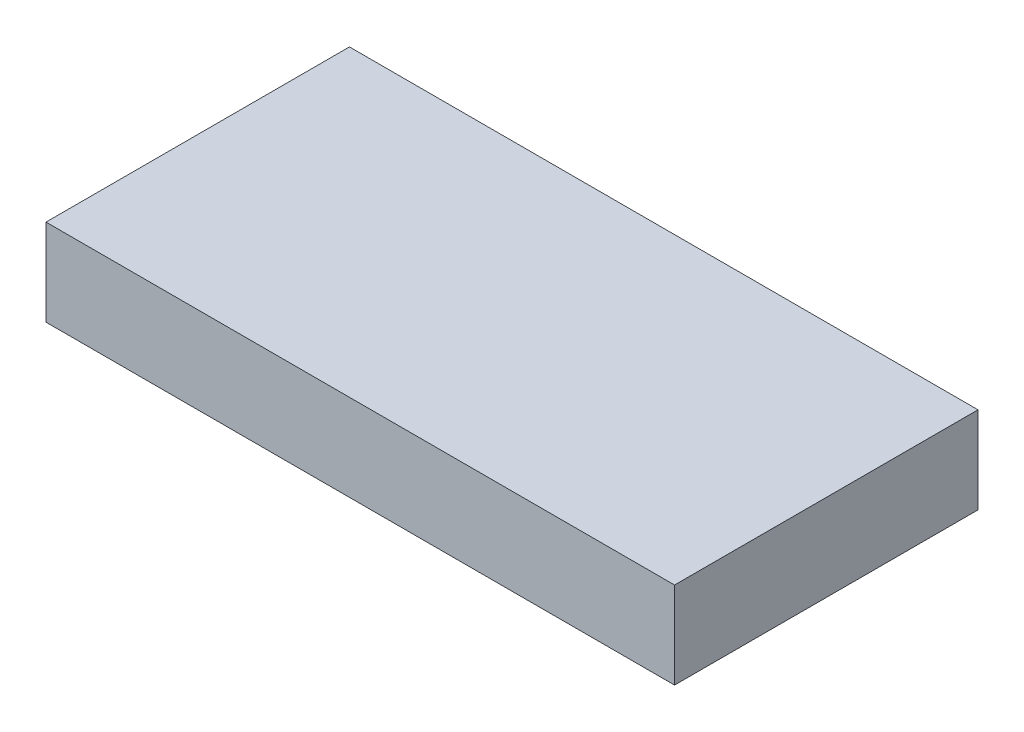
ISO-10303-21;
HEADER;
FILE_DESCRIPTION(('STEP AP214'),'2;1');
FILE_NAME('part.step','',(''),(''),'','','');
FILE_SCHEMA(('AUTOMOTIVE_DESIGN { 1 0 10303 214 1 1 1 1 }'));
ENDSEC;
DATA;
#1=APPLICATION_CONTEXT('core data for automotive mechanical design processes');
#2=APPLICATION_PROTOCOL_DEFINITION('international standard','automotive_design',2000,#1);
#3=PRODUCT_CONTEXT('',#1,'mechanical');
#4=PRODUCT('Part','Part','',(#3));
#5=PRODUCT_RELATED_PRODUCT_CATEGORY('part','',(#4));
#6=PRODUCT_DEFINITION_FORMATION('','',#4);
#7=PRODUCT_DEFINITION_CONTEXT('part definition',#1,'design');
#8=PRODUCT_DEFINITION('design','',#6,#7);
#9=PRODUCT_DEFINITION_SHAPE('','',#8);
#10=(LENGTH_UNIT() NAMED_UNIT(*) SI_UNIT(.MILLI.,.METRE.));
#11=(NAMED_UNIT(*) PLANE_ANGLE_UNIT() SI_UNIT($,.RADIAN.));
#12=(NAMED_UNIT(*) SI_UNIT($,.STERADIAN.) SOLID_ANGLE_UNIT());
#13=UNCERTAINTY_MEASURE_WITH_UNIT(LENGTH_MEASURE(1.E-05),#10,'distance_accuracy_value','');
#14=(GEOMETRIC_REPRESENTATION_CONTEXT(3) GLOBAL_UNCERTAINTY_ASSIGNED_CONTEXT((#13)) GLOBAL_UNIT_ASSIGNED_CONTEXT((#10,
#11,#12)) REPRESENTATION_CONTEXT('',''));
#15=CARTESIAN_POINT('',(0.,0.,0.));
#16=DIRECTION('',(0.,0.,1.));
#17=DIRECTION('',(1.,0.,0.));
#18=AXIS2_PLACEMENT_3D('',#15,#16,#17);
#19=CARTESIAN_POINT('',(14.5,2.,7.));
#20=DIRECTION('',(-1.,0.,0.));
#21=DIRECTION('',(0.,0.,1.));
#22=AXIS2_PLACEMENT_3D('',#19,#20,#21);
#23=PLANE('',#22);
#24=DIRECTION('',(0.,0.,-1.));
#25=VECTOR('',#24,1.);
#26=CARTESIAN_POINT('',(14.5,-2.,7.));
#27=LINE('',#26,#25);
#28=CARTESIAN_POINT('',(14.5,-2.,7.));
#29=VERTEX_POINT('',#28);
#30=CARTESIAN_POINT('',(14.5,-2.,-7.));
#31=VERTEX_POINT('',#30);
#32=EDGE_CURVE('E106',#29,#31,#27,.T.);
#33=ORIENTED_EDGE('',*,*,#32,.T.);
#34=DIRECTION('',(0.,-1.,0.));
#35=VECTOR('',#34,1.);
#36=CARTESIAN_POINT('',(14.5,2.,-7.));
#37=LINE('',#36,#35);
#38=CARTESIAN_POINT('',(14.5,2.,-7.));
#39=VERTEX_POINT('',#38);
#40=EDGE_CURVE('E11',#39,#31,#37,.T.);
#41=ORIENTED_EDGE('',*,*,#40,.F.);
#42=DIRECTION('',(0.,0.,-1.));
#43=VECTOR('',#42,1.);
#44=CARTESIAN_POINT('',(14.5,2.,7.));
#45=LINE('',#44,#43);
#46=CARTESIAN_POINT('',(14.5,2.,7.));
#47=VERTEX_POINT('',#46);
#48=EDGE_CURVE('E90',#47,#39,#45,.T.);
#49=ORIENTED_EDGE('',*,*,#48,.F.);
#50=DIRECTION('',(0.,-1.,0.));
#51=VECTOR('',#50,1.);
#52=CARTESIAN_POINT('',(14.5,2.,7.));
#53=LINE('',#52,#51);
#54=EDGE_CURVE('E102',#47,#29,#53,.T.);
#55=ORIENTED_EDGE('',*,*,#54,.T.);
#56=EDGE_LOOP('',(#33,#41,#49,#55));
#57=FACE_BOUND('',#56,.T.);
#58=ADVANCED_FACE('F38',(#57),#23,.F.);
#59=CARTESIAN_POINT('',(-14.5,2.,-7.));
#60=DIRECTION('',(0.,0.,1.));
#61=DIRECTION('',(1.,0.,0.));
#62=AXIS2_PLACEMENT_3D('',#59,#60,#61);
#63=PLANE('',#62);
#64=DIRECTION('',(-1.,0.,0.));
#65=VECTOR('',#64,1.);
#66=CARTESIAN_POINT('',(-14.5,-2.,-7.));
#67=LINE('',#66,#65);
#68=CARTESIAN_POINT('',(-14.5,-2.,-7.));
#69=VERTEX_POINT('',#68);
#70=EDGE_CURVE('E95',#31,#69,#67,.T.);
#71=ORIENTED_EDGE('',*,*,#70,.T.);
#72=DIRECTION('',(0.,-1.,0.));
#73=VECTOR('',#72,1.);
#74=CARTESIAN_POINT('',(-14.5,2.,-7.));
#75=LINE('',#74,#73);
#76=CARTESIAN_POINT('',(-14.5,2.,-7.));
#77=VERTEX_POINT('',#76);
#78=EDGE_CURVE('E47',#77,#69,#75,.T.);
#79=ORIENTED_EDGE('',*,*,#78,.F.);
#80=DIRECTION('',(-1.,0.,0.));
#81=VECTOR('',#80,1.);
#82=CARTESIAN_POINT('',(-14.5,2.,-7.));
#83=LINE('',#82,#81);
#84=EDGE_CURVE('E85',#39,#77,#83,.T.);
#85=ORIENTED_EDGE('',*,*,#84,.F.);
#86=ORIENTED_EDGE('',*,*,#40,.T.);
#87=EDGE_LOOP('',(#71,#79,#85,#86));
#88=FACE_BOUND('',#87,.T.);
#89=ADVANCED_FACE('F94',(#88),#63,.F.);
#90=CARTESIAN_POINT('',(-14.5,2.,7.));
#91=DIRECTION('',(1.,0.,0.));
#92=DIRECTION('',(0.,0.,-1.));
#93=AXIS2_PLACEMENT_3D('',#90,#91,#92);
#94=PLANE('',#93);
#95=DIRECTION('',(0.,0.,1.));
#96=VECTOR('',#95,1.);
#97=CARTESIAN_POINT('',(-14.5,-2.,7.));
#98=LINE('',#97,#96);
#99=CARTESIAN_POINT('',(-14.5,-2.,7.));
#100=VERTEX_POINT('',#99);
#101=EDGE_CURVE('E72',#69,#100,#98,.T.);
#102=ORIENTED_EDGE('',*,*,#101,.T.);
#103=DIRECTION('',(0.,-1.,0.));
#104=VECTOR('',#103,1.);
#105=CARTESIAN_POINT('',(-14.5,2.,7.));
#106=LINE('',#105,#104);
#107=CARTESIAN_POINT('',(-14.5,2.,7.));
#108=VERTEX_POINT('',#107);
#109=EDGE_CURVE('E97',#108,#100,#106,.T.);
#110=ORIENTED_EDGE('',*,*,#109,.F.);
#111=DIRECTION('',(0.,0.,1.));
#112=VECTOR('',#111,1.);
#113=CARTESIAN_POINT('',(-14.5,2.,7.));
#114=LINE('',#113,#112);
#115=EDGE_CURVE('E88',#77,#108,#114,.T.);
#116=ORIENTED_EDGE('',*,*,#115,.F.);
#117=ORIENTED_EDGE('',*,*,#78,.T.);
#118=EDGE_LOOP('',(#102,#110,#116,#117));
#119=FACE_BOUND('',#118,.T.);
#120=ADVANCED_FACE('F98',(#119),#94,.F.);
#121=CARTESIAN_POINT('',(-14.5,2.,7.));
#122=DIRECTION('',(0.,0.,-1.));
#123=DIRECTION('',(-1.,0.,0.));
#124=AXIS2_PLACEMENT_3D('',#121,#122,#123);
#125=PLANE('',#124);
#126=DIRECTION('',(1.,0.,0.));
#127=VECTOR('',#126,1.);
#128=CARTESIAN_POINT('',(-14.5,-2.,7.));
#129=LINE('',#128,#127);
#130=EDGE_CURVE('E78',#100,#29,#129,.T.);
#131=ORIENTED_EDGE('',*,*,#130,.T.);
#132=ORIENTED_EDGE('',*,*,#54,.F.);
#133=DIRECTION('',(1.,0.,0.));
#134=VECTOR('',#133,1.);
#135=CARTESIAN_POINT('',(-14.5,2.,7.));
#136=LINE('',#135,#134);
#137=EDGE_CURVE('E55',#108,#47,#136,.T.);
#138=ORIENTED_EDGE('',*,*,#137,.F.);
#139=ORIENTED_EDGE('',*,*,#109,.T.);
#140=EDGE_LOOP('',(#131,#132,#138,#139));
#141=FACE_BOUND('',#140,.T.);
#142=ADVANCED_FACE('F119',(#141),#125,.F.);
#143=CARTESIAN_POINT('',(0.,2.,0.));
#144=DIRECTION('',(0.,-1.,0.));
#145=DIRECTION('',(0.,0.,-1.));
#146=AXIS2_PLACEMENT_3D('',#143,#144,#145);
#147=PLANE('',#146);
#148=ORIENTED_EDGE('',*,*,#48,.T.);
#149=ORIENTED_EDGE('',*,*,#84,.T.);
#150=ORIENTED_EDGE('',*,*,#115,.T.);
#151=ORIENTED_EDGE('',*,*,#137,.T.);
#152=EDGE_LOOP('',(#148,#149,#150,#151));
#153=FACE_BOUND('',#152,.T.);
#154=ADVANCED_FACE('F86',(#153),#147,.F.);
#155=CARTESIAN_POINT('',(0.,-2.,0.));
#156=DIRECTION('',(0.,-1.,0.));
#157=DIRECTION('',(0.,0.,-1.));
#158=AXIS2_PLACEMENT_3D('',#155,#156,#157);
#159=PLANE('',#158);
#160=ORIENTED_EDGE('',*,*,#32,.F.);
#161=ORIENTED_EDGE('',*,*,#130,.F.);
#162=ORIENTED_EDGE('',*,*,#101,.F.);
#163=ORIENTED_EDGE('',*,*,#70,.F.);
#164=EDGE_LOOP('',(#160,#161,#162,#163));
#165=FACE_BOUND('',#164,.T.);
#166=ADVANCED_FACE('F122',(#165),#159,.T.);
#167=CLOSED_SHELL('',(#58,#89,#120,#142,#154,#166));
#168=MANIFOLD_SOLID_BREP('B2',#167);
#169=ADVANCED_BREP_SHAPE_REPRESENTATION('',(#18,#168),#14);
#170=SHAPE_DEFINITION_REPRESENTATION(#9,#169);
ENDSEC;
END-ISO-10303-21;
